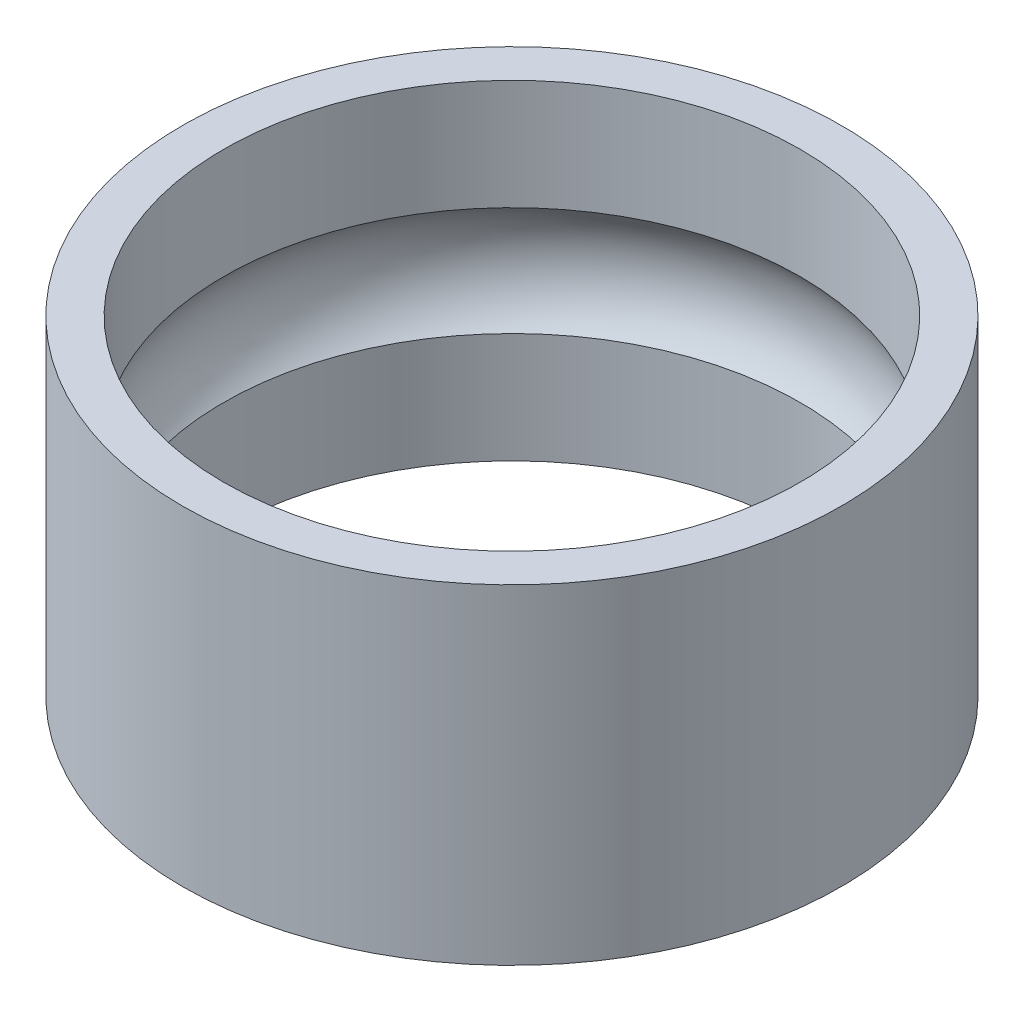
ISO-10303-21;
HEADER;
FILE_DESCRIPTION(('STEP AP214'),'2;1');
FILE_NAME('part.step','',(''),(''),'','','');
FILE_SCHEMA(('AUTOMOTIVE_DESIGN { 1 0 10303 214 1 1 1 1 }'));
ENDSEC;
DATA;
#1=APPLICATION_CONTEXT('core data for automotive mechanical design processes');
#2=APPLICATION_PROTOCOL_DEFINITION('international standard','automotive_design',2000,#1);
#3=PRODUCT_CONTEXT('',#1,'mechanical');
#4=PRODUCT('Part','Part','',(#3));
#5=PRODUCT_RELATED_PRODUCT_CATEGORY('part','',(#4));
#6=PRODUCT_DEFINITION_FORMATION('','',#4);
#7=PRODUCT_DEFINITION_CONTEXT('part definition',#1,'design');
#8=PRODUCT_DEFINITION('design','',#6,#7);
#9=PRODUCT_DEFINITION_SHAPE('','',#8);
#10=(LENGTH_UNIT() NAMED_UNIT(*) SI_UNIT(.MILLI.,.METRE.));
#11=(NAMED_UNIT(*) PLANE_ANGLE_UNIT() SI_UNIT($,.RADIAN.));
#12=(NAMED_UNIT(*) SI_UNIT($,.STERADIAN.) SOLID_ANGLE_UNIT());
#13=UNCERTAINTY_MEASURE_WITH_UNIT(LENGTH_MEASURE(1.E-05),#10,'distance_accuracy_value','');
#14=(GEOMETRIC_REPRESENTATION_CONTEXT(3) GLOBAL_UNCERTAINTY_ASSIGNED_CONTEXT((#13)) GLOBAL_UNIT_ASSIGNED_CONTEXT((#10,
#11,#12)) REPRESENTATION_CONTEXT('',''));
#15=CARTESIAN_POINT('',(0.,0.,0.));
#16=DIRECTION('',(0.,0.,1.));
#17=DIRECTION('',(1.,0.,0.));
#18=AXIS2_PLACEMENT_3D('',#15,#16,#17);
#19=CARTESIAN_POINT('',(0.,2.,0.));
#20=DIRECTION('',(0.,-1.,0.));
#21=DIRECTION('',(0.,0.,-1.));
#22=AXIS2_PLACEMENT_3D('',#19,#20,#21);
#23=CYLINDRICAL_SURFACE('',#22,3.5);
#24=CARTESIAN_POINT('',(0.,2.,0.));
#25=DIRECTION('',(0.,1.,0.));
#26=DIRECTION('',(0.,0.,1.));
#27=AXIS2_PLACEMENT_3D('',#24,#25,#26);
#28=CIRCLE('',#27,3.5);
#29=CARTESIAN_POINT('',(0.,2.,3.5));
#30=VERTEX_POINT('',#29);
#31=EDGE_CURVE('E50',#30,#30,#28,.T.);
#32=ORIENTED_EDGE('',*,*,#31,.T.);
#33=EDGE_LOOP('',(#32));
#34=FACE_BOUND('',#33,.T.);
#35=CARTESIAN_POINT('',(0.,0.661437827766148,0.));
#36=DIRECTION('',(0.,-1.,0.));
#37=DIRECTION('',(0.,0.,-1.));
#38=AXIS2_PLACEMENT_3D('',#35,#36,#37);
#39=CIRCLE('',#38,3.5);
#40=CARTESIAN_POINT('',(0.,0.661437827766148,-3.5));
#41=VERTEX_POINT('',#40);
#42=EDGE_CURVE('E38',#41,#41,#39,.T.);
#43=ORIENTED_EDGE('',*,*,#42,.T.);
#44=EDGE_LOOP('',(#43));
#45=FACE_BOUND('',#44,.T.);
#46=ADVANCED_FACE('F34',(#34,#45),#23,.F.);
#47=CARTESIAN_POINT('',(0.,-2.,0.));
#48=DIRECTION('',(0.,1.,0.));
#49=DIRECTION('',(0.,0.,1.));
#50=AXIS2_PLACEMENT_3D('',#47,#48,#49);
#51=CIRCLE('',#50,3.5);
#52=CARTESIAN_POINT('',(0.,-2.,3.5));
#53=VERTEX_POINT('',#52);
#54=EDGE_CURVE('E53',#53,#53,#51,.T.);
#55=ORIENTED_EDGE('',*,*,#54,.F.);
#56=EDGE_LOOP('',(#55));
#57=FACE_BOUND('',#56,.T.);
#58=CARTESIAN_POINT('',(0.,-0.661437827766148,0.));
#59=DIRECTION('',(0.,1.,0.));
#60=DIRECTION('',(0.,0.,1.));
#61=AXIS2_PLACEMENT_3D('',#58,#59,#60);
#62=CIRCLE('',#61,3.5);
#63=CARTESIAN_POINT('',(0.,-0.661437827766148,3.5));
#64=VERTEX_POINT('',#63);
#65=EDGE_CURVE('E55',#64,#64,#62,.T.);
#66=ORIENTED_EDGE('',*,*,#65,.T.);
#67=EDGE_LOOP('',(#66));
#68=FACE_BOUND('',#67,.T.);
#69=ADVANCED_FACE('F75',(#57,#68),#23,.F.);
#70=CARTESIAN_POINT('',(0.,2.,0.));
#71=DIRECTION('',(0.,1.,0.));
#72=DIRECTION('',(0.,0.,1.));
#73=AXIS2_PLACEMENT_3D('',#70,#71,#72);
#74=PLANE('',#73);
#75=CARTESIAN_POINT('',(0.,2.,0.));
#76=DIRECTION('',(0.,1.,0.));
#77=DIRECTION('',(0.,0.,1.));
#78=AXIS2_PLACEMENT_3D('',#75,#76,#77);
#79=CIRCLE('',#78,4.);
#80=CARTESIAN_POINT('',(0.,2.,4.));
#81=VERTEX_POINT('',#80);
#82=EDGE_CURVE('E10',#81,#81,#79,.T.);
#83=ORIENTED_EDGE('',*,*,#82,.T.);
#84=EDGE_LOOP('',(#83));
#85=FACE_BOUND('',#84,.T.);
#86=ORIENTED_EDGE('',*,*,#31,.F.);
#87=EDGE_LOOP('',(#86));
#88=FACE_BOUND('',#87,.T.);
#89=ADVANCED_FACE('F72',(#85,#88),#74,.T.);
#90=CARTESIAN_POINT('',(0.,-2.,0.));
#91=DIRECTION('',(0.,1.,0.));
#92=DIRECTION('',(0.,0.,1.));
#93=AXIS2_PLACEMENT_3D('',#90,#91,#92);
#94=PLANE('',#93);
#95=CARTESIAN_POINT('',(0.,-2.,0.));
#96=DIRECTION('',(0.,1.,0.));
#97=DIRECTION('',(0.,0.,1.));
#98=AXIS2_PLACEMENT_3D('',#95,#96,#97);
#99=CIRCLE('',#98,4.);
#100=CARTESIAN_POINT('',(0.,-2.,4.));
#101=VERTEX_POINT('',#100);
#102=EDGE_CURVE('E43',#101,#101,#99,.T.);
#103=ORIENTED_EDGE('',*,*,#102,.F.);
#104=EDGE_LOOP('',(#103));
#105=FACE_BOUND('',#104,.T.);
#106=ORIENTED_EDGE('',*,*,#54,.T.);
#107=EDGE_LOOP('',(#106));
#108=FACE_BOUND('',#107,.T.);
#109=ADVANCED_FACE('F74',(#105,#108),#94,.F.);
#110=CARTESIAN_POINT('',(0.,2.,0.));
#111=DIRECTION('',(0.,-1.,0.));
#112=DIRECTION('',(0.,0.,-1.));
#113=AXIS2_PLACEMENT_3D('',#110,#111,#112);
#114=CYLINDRICAL_SURFACE('',#113,4.);
#115=ORIENTED_EDGE('',*,*,#82,.F.);
#116=EDGE_LOOP('',(#115));
#117=FACE_BOUND('',#116,.T.);
#118=ORIENTED_EDGE('',*,*,#102,.T.);
#119=EDGE_LOOP('',(#118));
#120=FACE_BOUND('',#119,.T.);
#121=ADVANCED_FACE('F36',(#117,#120),#114,.T.);
#122=CARTESIAN_POINT('',(0.,0.,0.));
#123=DIRECTION('',(0.,1.,0.));
#124=DIRECTION('',(0.,0.,1.));
#125=AXIS2_PLACEMENT_3D('',#122,#123,#124);
#126=TOROIDAL_SURFACE('',#125,2.75,1.);
#127=ORIENTED_EDGE('',*,*,#42,.F.);
#128=EDGE_LOOP('',(#127));
#129=FACE_BOUND('',#128,.T.);
#130=ORIENTED_EDGE('',*,*,#65,.F.);
#131=EDGE_LOOP('',(#130));
#132=FACE_BOUND('',#131,.T.);
#133=ADVANCED_FACE('F88',(#129,#132),#126,.F.);
#134=CLOSED_SHELL('',(#46,#69,#89,#109,#121,#133));
#135=MANIFOLD_SOLID_BREP('B2',#134);
#136=ADVANCED_BREP_SHAPE_REPRESENTATION('',(#18,#135),#14);
#137=SHAPE_DEFINITION_REPRESENTATION(#9,#136);
ENDSEC;
END-ISO-10303-21;
